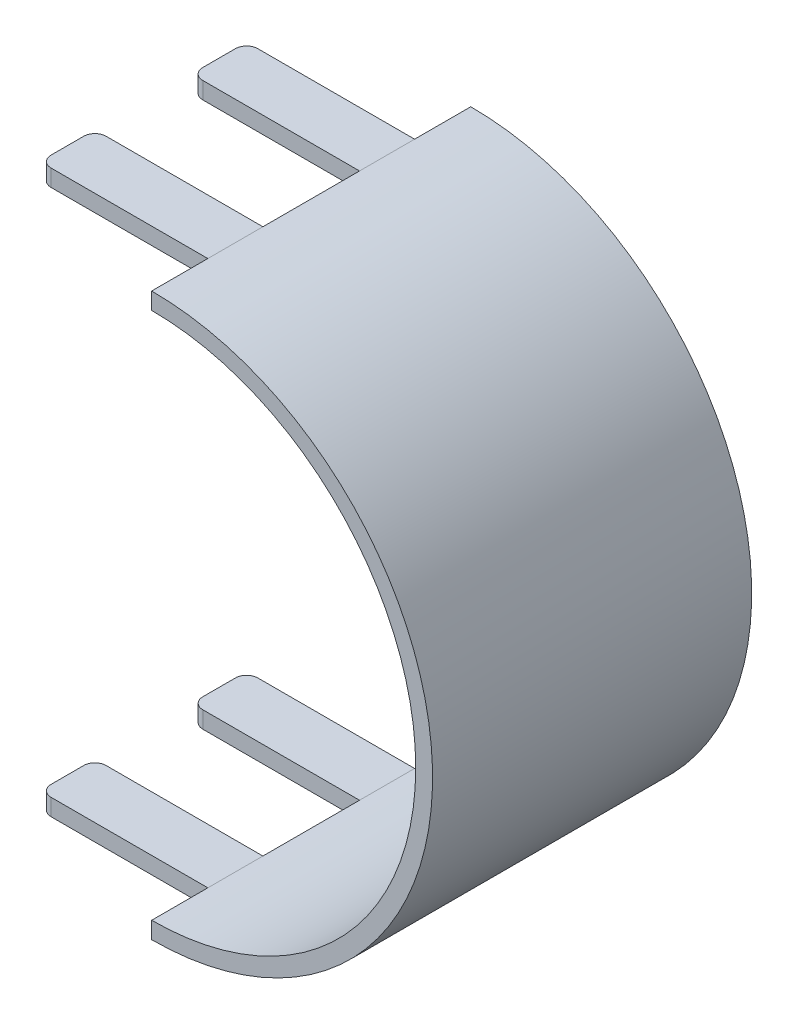
ISO-10303-21;
HEADER;
FILE_DESCRIPTION(('STEP AP214'),'2;1');
FILE_NAME('part.step','',(''),(''),'','','');
FILE_SCHEMA(('AUTOMOTIVE_DESIGN { 1 0 10303 214 1 1 1 1 }'));
ENDSEC;
DATA;
#1=APPLICATION_CONTEXT('core data for automotive mechanical design processes');
#2=APPLICATION_PROTOCOL_DEFINITION('international standard','automotive_design',2000,#1);
#3=PRODUCT_CONTEXT('',#1,'mechanical');
#4=PRODUCT('Part','Part','',(#3));
#5=PRODUCT_RELATED_PRODUCT_CATEGORY('part','',(#4));
#6=PRODUCT_DEFINITION_FORMATION('','',#4);
#7=PRODUCT_DEFINITION_CONTEXT('part definition',#1,'design');
#8=PRODUCT_DEFINITION('design','',#6,#7);
#9=PRODUCT_DEFINITION_SHAPE('','',#8);
#10=(LENGTH_UNIT() NAMED_UNIT(*) SI_UNIT(.MILLI.,.METRE.));
#11=(NAMED_UNIT(*) PLANE_ANGLE_UNIT() SI_UNIT($,.RADIAN.));
#12=(NAMED_UNIT(*) SI_UNIT($,.STERADIAN.) SOLID_ANGLE_UNIT());
#13=UNCERTAINTY_MEASURE_WITH_UNIT(LENGTH_MEASURE(1.E-05),#10,'distance_accuracy_value','');
#14=(GEOMETRIC_REPRESENTATION_CONTEXT(3) GLOBAL_UNCERTAINTY_ASSIGNED_CONTEXT((#13)) GLOBAL_UNIT_ASSIGNED_CONTEXT((#10,
#11,#12)) REPRESENTATION_CONTEXT('',''));
#15=CARTESIAN_POINT('',(0.,0.,0.));
#16=DIRECTION('',(0.,0.,1.));
#17=DIRECTION('',(1.,0.,0.));
#18=AXIS2_PLACEMENT_3D('',#15,#16,#17);
#19=CARTESIAN_POINT('',(300.,0.,60.));
#20=DIRECTION('',(0.,0.,-1.));
#21=DIRECTION('',(-1.,0.,0.));
#22=AXIS2_PLACEMENT_3D('',#19,#20,#21);
#23=CYLINDRICAL_SURFACE('',#22,50.);
#24=DIRECTION('',(0.,0.,-1.));
#25=VECTOR('',#24,1.);
#26=CARTESIAN_POINT('',(300.,50.,60.));
#27=LINE('',#26,#25);
#28=CARTESIAN_POINT('',(300.,50.,59.9));
#29=VERTEX_POINT('',#28);
#30=CARTESIAN_POINT('',(300.,50.,49.9));
#31=VERTEX_POINT('',#30);
#32=EDGE_CURVE('E258',#29,#31,#27,.T.);
#33=ORIENTED_EDGE('',*,*,#32,.F.);
#34=CARTESIAN_POINT('',(300.,0.,59.9));
#35=DIRECTION('',(0.,0.,-1.));
#36=DIRECTION('',(-1.,0.,0.));
#37=AXIS2_PLACEMENT_3D('',#34,#35,#36);
#38=CIRCLE('',#37,50.);
#39=CARTESIAN_POINT('',(300.,-50.,59.9));
#40=VERTEX_POINT('',#39);
#41=EDGE_CURVE('E225',#29,#40,#38,.T.);
#42=ORIENTED_EDGE('',*,*,#41,.T.);
#43=DIRECTION('',(0.,0.,-1.));
#44=VECTOR('',#43,1.);
#45=CARTESIAN_POINT('',(300.,-50.,60.));
#46=LINE('',#45,#44);
#47=CARTESIAN_POINT('',(300.,-50.,49.9));
#48=VERTEX_POINT('',#47);
#49=EDGE_CURVE('E256',#40,#48,#46,.T.);
#50=ORIENTED_EDGE('',*,*,#49,.T.);
#51=DIRECTION('',(0.,0.,-1.));
#52=VECTOR('',#51,1.);
#53=CARTESIAN_POINT('',(300.,-50.,60.));
#54=LINE('',#53,#52);
#55=CARTESIAN_POINT('',(300.,-50.,40.1));
#56=VERTEX_POINT('',#55);
#57=EDGE_CURVE('E434',#48,#56,#54,.T.);
#58=ORIENTED_EDGE('',*,*,#57,.T.);
#59=CARTESIAN_POINT('',(300.,-50.,22.9));
#60=VERTEX_POINT('',#59);
#61=EDGE_CURVE('E447',#56,#60,#46,.T.);
#62=ORIENTED_EDGE('',*,*,#61,.T.);
#63=DIRECTION('',(0.,0.,-1.));
#64=VECTOR('',#63,1.);
#65=CARTESIAN_POINT('',(300.,-50.,60.));
#66=LINE('',#65,#64);
#67=CARTESIAN_POINT('',(300.,-50.,13.1));
#68=VERTEX_POINT('',#67);
#69=EDGE_CURVE('E431',#60,#68,#66,.T.);
#70=ORIENTED_EDGE('',*,*,#69,.T.);
#71=CARTESIAN_POINT('',(300.,-50.,3.1));
#72=VERTEX_POINT('',#71);
#73=EDGE_CURVE('E260',#68,#72,#46,.T.);
#74=ORIENTED_EDGE('',*,*,#73,.T.);
#75=CARTESIAN_POINT('',(300.,0.,3.1));
#76=DIRECTION('',(0.,0.,-1.));
#77=DIRECTION('',(-1.,0.,0.));
#78=AXIS2_PLACEMENT_3D('',#75,#76,#77);
#79=CIRCLE('',#78,50.);
#80=CARTESIAN_POINT('',(300.,50.,3.1));
#81=VERTEX_POINT('',#80);
#82=EDGE_CURVE('E361',#81,#72,#79,.T.);
#83=ORIENTED_EDGE('',*,*,#82,.F.);
#84=CARTESIAN_POINT('',(300.,50.,13.1));
#85=VERTEX_POINT('',#84);
#86=EDGE_CURVE('E250',#85,#81,#27,.T.);
#87=ORIENTED_EDGE('',*,*,#86,.F.);
#88=DIRECTION('',(0.,0.,-1.));
#89=VECTOR('',#88,1.);
#90=CARTESIAN_POINT('',(300.,50.,60.));
#91=LINE('',#90,#89);
#92=CARTESIAN_POINT('',(300.,50.,22.9));
#93=VERTEX_POINT('',#92);
#94=EDGE_CURVE('E424',#93,#85,#91,.T.);
#95=ORIENTED_EDGE('',*,*,#94,.F.);
#96=CARTESIAN_POINT('',(300.,50.,40.1));
#97=VERTEX_POINT('',#96);
#98=EDGE_CURVE('E261',#97,#93,#27,.T.);
#99=ORIENTED_EDGE('',*,*,#98,.F.);
#100=DIRECTION('',(0.,0.,-1.));
#101=VECTOR('',#100,1.);
#102=CARTESIAN_POINT('',(300.,50.,60.));
#103=LINE('',#102,#101);
#104=EDGE_CURVE('E440',#31,#97,#103,.T.);
#105=ORIENTED_EDGE('',*,*,#104,.F.);
#106=EDGE_LOOP('',(#33,#42,#50,#58,#62,#70,#74,#83,#87,#95,#99,#105));
#107=FACE_BOUND('',#106,.T.);
#108=ADVANCED_FACE('F33',(#107),#23,.T.);
#109=CARTESIAN_POINT('',(300.,1.71683972880179E-13,0.));
#110=DIRECTION('',(-1.,0.,0.));
#111=DIRECTION('',(0.,-1.,0.));
#112=AXIS2_PLACEMENT_3D('',#109,#110,#111);
#113=PLANE('',#112);
#114=DIRECTION('',(0.,0.,1.));
#115=VECTOR('',#114,1.);
#116=CARTESIAN_POINT('',(300.,-47.,3.));
#117=LINE('',#116,#115);
#118=CARTESIAN_POINT('',(300.,-47.,3.1));
#119=VERTEX_POINT('',#118);
#120=CARTESIAN_POINT('',(300.,-47.,13.1));
#121=VERTEX_POINT('',#120);
#122=EDGE_CURVE('E263',#119,#121,#117,.T.);
#123=ORIENTED_EDGE('',*,*,#122,.F.);
#124=DIRECTION('',(0.,-1.,0.));
#125=VECTOR('',#124,1.);
#126=CARTESIAN_POINT('',(300.,1.71683972880179E-13,3.1));
#127=LINE('',#126,#125);
#128=EDGE_CURVE('E462',#119,#72,#127,.T.);
#129=ORIENTED_EDGE('',*,*,#128,.T.);
#130=ORIENTED_EDGE('',*,*,#73,.F.);
#131=DIRECTION('',(0.,1.,0.));
#132=VECTOR('',#131,1.);
#133=CARTESIAN_POINT('',(300.,-120.,13.1));
#134=LINE('',#133,#132);
#135=EDGE_CURVE('E401',#68,#121,#134,.T.);
#136=ORIENTED_EDGE('',*,*,#135,.T.);
#137=EDGE_LOOP('',(#123,#129,#130,#136));
#138=FACE_BOUND('',#137,.T.);
#139=ADVANCED_FACE('F460',(#138),#113,.T.);
#140=CARTESIAN_POINT('',(300.,0.,3.));
#141=DIRECTION('',(0.,0.,1.));
#142=DIRECTION('',(1.,0.,0.));
#143=AXIS2_PLACEMENT_3D('',#140,#141,#142);
#144=CYLINDRICAL_SURFACE('',#143,47.);
#145=CARTESIAN_POINT('',(300.,-47.,49.9));
#146=VERTEX_POINT('',#145);
#147=CARTESIAN_POINT('',(300.,-47.,59.9));
#148=VERTEX_POINT('',#147);
#149=EDGE_CURVE('E239',#146,#148,#117,.T.);
#150=ORIENTED_EDGE('',*,*,#149,.T.);
#151=CARTESIAN_POINT('',(300.,0.,59.9));
#152=DIRECTION('',(0.,0.,-1.));
#153=DIRECTION('',(-1.,0.,0.));
#154=AXIS2_PLACEMENT_3D('',#151,#152,#153);
#155=CIRCLE('',#154,47.);
#156=CARTESIAN_POINT('',(300.,47.,59.9));
#157=VERTEX_POINT('',#156);
#158=EDGE_CURVE('E222',#148,#157,#155,.F.);
#159=ORIENTED_EDGE('',*,*,#158,.T.);
#160=DIRECTION('',(0.,0.,1.));
#161=VECTOR('',#160,1.);
#162=CARTESIAN_POINT('',(300.,47.,3.));
#163=LINE('',#162,#161);
#164=CARTESIAN_POINT('',(300.,47.,49.9));
#165=VERTEX_POINT('',#164);
#166=EDGE_CURVE('E236',#165,#157,#163,.T.);
#167=ORIENTED_EDGE('',*,*,#166,.F.);
#168=DIRECTION('',(0.,0.,1.));
#169=VECTOR('',#168,1.);
#170=CARTESIAN_POINT('',(300.,47.,3.));
#171=LINE('',#170,#169);
#172=CARTESIAN_POINT('',(300.,47.,40.1));
#173=VERTEX_POINT('',#172);
#174=EDGE_CURVE('E252',#173,#165,#171,.T.);
#175=ORIENTED_EDGE('',*,*,#174,.F.);
#176=CARTESIAN_POINT('',(300.,47.,22.9));
#177=VERTEX_POINT('',#176);
#178=EDGE_CURVE('E247',#177,#173,#171,.T.);
#179=ORIENTED_EDGE('',*,*,#178,.F.);
#180=DIRECTION('',(0.,0.,1.));
#181=VECTOR('',#180,1.);
#182=CARTESIAN_POINT('',(300.,47.,3.));
#183=LINE('',#182,#181);
#184=CARTESIAN_POINT('',(300.,47.,13.1));
#185=VERTEX_POINT('',#184);
#186=EDGE_CURVE('E425',#185,#177,#183,.T.);
#187=ORIENTED_EDGE('',*,*,#186,.F.);
#188=CARTESIAN_POINT('',(300.,47.,3.1));
#189=VERTEX_POINT('',#188);
#190=EDGE_CURVE('E246',#189,#185,#163,.T.);
#191=ORIENTED_EDGE('',*,*,#190,.F.);
#192=CARTESIAN_POINT('',(300.,0.,3.1));
#193=DIRECTION('',(0.,0.,-1.));
#194=DIRECTION('',(-1.,0.,0.));
#195=AXIS2_PLACEMENT_3D('',#192,#193,#194);
#196=CIRCLE('',#195,47.);
#197=EDGE_CURVE('E840',#119,#189,#196,.F.);
#198=ORIENTED_EDGE('',*,*,#197,.F.);
#199=ORIENTED_EDGE('',*,*,#122,.T.);
#200=DIRECTION('',(0.,0.,1.));
#201=VECTOR('',#200,1.);
#202=CARTESIAN_POINT('',(300.,-47.,3.));
#203=LINE('',#202,#201);
#204=CARTESIAN_POINT('',(300.,-47.,22.9));
#205=VERTEX_POINT('',#204);
#206=EDGE_CURVE('E428',#121,#205,#203,.T.);
#207=ORIENTED_EDGE('',*,*,#206,.T.);
#208=DIRECTION('',(0.,0.,1.));
#209=VECTOR('',#208,1.);
#210=CARTESIAN_POINT('',(300.,-47.,3.));
#211=LINE('',#210,#209);
#212=CARTESIAN_POINT('',(300.,-47.,40.1));
#213=VERTEX_POINT('',#212);
#214=EDGE_CURVE('E437',#205,#213,#211,.T.);
#215=ORIENTED_EDGE('',*,*,#214,.T.);
#216=EDGE_CURVE('E441',#213,#146,#211,.T.);
#217=ORIENTED_EDGE('',*,*,#216,.T.);
#218=EDGE_LOOP('',(#150,#159,#167,#175,#179,#187,#191,#198,#199,#207,#215,#217));
#219=FACE_BOUND('',#218,.T.);
#220=ADVANCED_FACE('F234',(#219),#144,.F.);
#221=ORIENTED_EDGE('',*,*,#86,.T.);
#222=DIRECTION('',(0.,-1.,0.));
#223=VECTOR('',#222,1.);
#224=CARTESIAN_POINT('',(300.,1.71683972880179E-13,3.1));
#225=LINE('',#224,#223);
#226=EDGE_CURVE('E230',#81,#189,#225,.T.);
#227=ORIENTED_EDGE('',*,*,#226,.T.);
#228=ORIENTED_EDGE('',*,*,#190,.T.);
#229=EDGE_CURVE('E398',#185,#85,#134,.T.);
#230=ORIENTED_EDGE('',*,*,#229,.T.);
#231=EDGE_LOOP('',(#221,#227,#228,#230));
#232=FACE_BOUND('',#231,.T.);
#233=ADVANCED_FACE('F515',(#232),#113,.T.);
#234=CARTESIAN_POINT('',(300.,47.,3.));
#235=DIRECTION('',(0.,1.,0.));
#236=DIRECTION('',(0.,0.,1.));
#237=AXIS2_PLACEMENT_3D('',#234,#235,#236);
#238=PLANE('',#237);
#239=DIRECTION('',(0.,0.,-1.));
#240=VECTOR('',#239,1.);
#241=CARTESIAN_POINT('',(270.1,47.,3.));
#242=LINE('',#241,#240);
#243=CARTESIAN_POINT('',(270.1,47.,20.9));
#244=VERTEX_POINT('',#243);
#245=CARTESIAN_POINT('',(270.1,47.,15.1));
#246=VERTEX_POINT('',#245);
#247=EDGE_CURVE('E370',#244,#246,#242,.T.);
#248=ORIENTED_EDGE('',*,*,#247,.T.);
#249=CARTESIAN_POINT('',(272.1,47.,15.1));
#250=DIRECTION('',(0.,1.,0.));
#251=DIRECTION('',(0.,0.,1.));
#252=AXIS2_PLACEMENT_3D('',#249,#250,#251);
#253=CIRCLE('',#252,2.);
#254=CARTESIAN_POINT('',(272.1,47.,13.1));
#255=VERTEX_POINT('',#254);
#256=EDGE_CURVE('E313',#246,#255,#253,.F.);
#257=ORIENTED_EDGE('',*,*,#256,.T.);
#258=DIRECTION('',(1.,0.,0.));
#259=VECTOR('',#258,1.);
#260=CARTESIAN_POINT('',(300.,47.,13.1));
#261=LINE('',#260,#259);
#262=EDGE_CURVE('E407',#255,#185,#261,.T.);
#263=ORIENTED_EDGE('',*,*,#262,.T.);
#264=ORIENTED_EDGE('',*,*,#186,.T.);
#265=DIRECTION('',(-1.,0.,0.));
#266=VECTOR('',#265,1.);
#267=CARTESIAN_POINT('',(300.,47.,22.9));
#268=LINE('',#267,#266);
#269=CARTESIAN_POINT('',(272.1,47.,22.9));
#270=VERTEX_POINT('',#269);
#271=EDGE_CURVE('E421',#177,#270,#268,.T.);
#272=ORIENTED_EDGE('',*,*,#271,.T.);
#273=CARTESIAN_POINT('',(272.1,47.,20.9));
#274=DIRECTION('',(0.,1.,0.));
#275=DIRECTION('',(0.,0.,1.));
#276=AXIS2_PLACEMENT_3D('',#273,#274,#275);
#277=CIRCLE('',#276,2.);
#278=EDGE_CURVE('E311',#270,#244,#277,.F.);
#279=ORIENTED_EDGE('',*,*,#278,.T.);
#280=EDGE_LOOP('',(#248,#257,#263,#264,#272,#279));
#281=FACE_BOUND('',#280,.T.);
#282=ADVANCED_FACE('F602',(#281),#238,.F.);
#283=CARTESIAN_POINT('',(300.,47.,3.));
#284=DIRECTION('',(0.,1.,0.));
#285=DIRECTION('',(0.,0.,1.));
#286=AXIS2_PLACEMENT_3D('',#283,#284,#285);
#287=PLANE('',#286);
#288=DIRECTION('',(0.,0.,-1.));
#289=VECTOR('',#288,1.);
#290=CARTESIAN_POINT('',(270.1,47.,3.));
#291=LINE('',#290,#289);
#292=CARTESIAN_POINT('',(270.1,47.,47.9));
#293=VERTEX_POINT('',#292);
#294=CARTESIAN_POINT('',(270.1,47.,42.1));
#295=VERTEX_POINT('',#294);
#296=EDGE_CURVE('E335',#293,#295,#291,.T.);
#297=ORIENTED_EDGE('',*,*,#296,.T.);
#298=CARTESIAN_POINT('',(272.1,47.,42.1));
#299=DIRECTION('',(0.,1.,0.));
#300=DIRECTION('',(0.,0.,1.));
#301=AXIS2_PLACEMENT_3D('',#298,#299,#300);
#302=CIRCLE('',#301,2.);
#303=CARTESIAN_POINT('',(272.1,47.,40.1));
#304=VERTEX_POINT('',#303);
#305=EDGE_CURVE('E41',#295,#304,#302,.F.);
#306=ORIENTED_EDGE('',*,*,#305,.T.);
#307=DIRECTION('',(1.,0.,0.));
#308=VECTOR('',#307,1.);
#309=CARTESIAN_POINT('',(300.,47.,40.1));
#310=LINE('',#309,#308);
#311=EDGE_CURVE('E334',#304,#173,#310,.T.);
#312=ORIENTED_EDGE('',*,*,#311,.T.);
#313=ORIENTED_EDGE('',*,*,#174,.T.);
#314=DIRECTION('',(-1.,0.,0.));
#315=VECTOR('',#314,1.);
#316=CARTESIAN_POINT('',(300.,47.,49.9));
#317=LINE('',#316,#315);
#318=CARTESIAN_POINT('',(272.1,47.,49.9));
#319=VERTEX_POINT('',#318);
#320=EDGE_CURVE('E391',#165,#319,#317,.T.);
#321=ORIENTED_EDGE('',*,*,#320,.T.);
#322=CARTESIAN_POINT('',(272.1,47.,47.9));
#323=DIRECTION('',(0.,1.,0.));
#324=DIRECTION('',(0.,0.,1.));
#325=AXIS2_PLACEMENT_3D('',#322,#323,#324);
#326=CIRCLE('',#325,2.);
#327=EDGE_CURVE('E329',#319,#293,#326,.F.);
#328=ORIENTED_EDGE('',*,*,#327,.T.);
#329=EDGE_LOOP('',(#297,#306,#312,#313,#321,#328));
#330=FACE_BOUND('',#329,.T.);
#331=ADVANCED_FACE('F333',(#330),#287,.F.);
#332=CARTESIAN_POINT('',(-300.,-47.,3.));
#333=DIRECTION('',(0.,-1.,0.));
#334=DIRECTION('',(0.,0.,-1.));
#335=AXIS2_PLACEMENT_3D('',#332,#333,#334);
#336=PLANE('',#335);
#337=DIRECTION('',(0.,0.,1.));
#338=VECTOR('',#337,1.);
#339=CARTESIAN_POINT('',(270.1,-47.,3.));
#340=LINE('',#339,#338);
#341=CARTESIAN_POINT('',(270.1,-47.,42.1));
#342=VERTEX_POINT('',#341);
#343=CARTESIAN_POINT('',(270.1,-47.,47.9));
#344=VERTEX_POINT('',#343);
#345=EDGE_CURVE('E367',#342,#344,#340,.T.);
#346=ORIENTED_EDGE('',*,*,#345,.T.);
#347=CARTESIAN_POINT('',(272.1,-47.,47.9));
#348=DIRECTION('',(0.,-1.,0.));
#349=DIRECTION('',(0.,0.,-1.));
#350=AXIS2_PLACEMENT_3D('',#347,#348,#349);
#351=CIRCLE('',#350,2.);
#352=CARTESIAN_POINT('',(272.1,-47.,49.9));
#353=VERTEX_POINT('',#352);
#354=EDGE_CURVE('E277',#344,#353,#351,.F.);
#355=ORIENTED_EDGE('',*,*,#354,.T.);
#356=DIRECTION('',(1.,0.,0.));
#357=VECTOR('',#356,1.);
#358=CARTESIAN_POINT('',(-300.,-47.,49.9));
#359=LINE('',#358,#357);
#360=EDGE_CURVE('E389',#353,#146,#359,.T.);
#361=ORIENTED_EDGE('',*,*,#360,.T.);
#362=ORIENTED_EDGE('',*,*,#216,.F.);
#363=DIRECTION('',(-1.,0.,0.));
#364=VECTOR('',#363,1.);
#365=CARTESIAN_POINT('',(-300.,-47.,40.1));
#366=LINE('',#365,#364);
#367=CARTESIAN_POINT('',(272.1,-47.,40.1));
#368=VERTEX_POINT('',#367);
#369=EDGE_CURVE('E345',#213,#368,#366,.T.);
#370=ORIENTED_EDGE('',*,*,#369,.T.);
#371=CARTESIAN_POINT('',(272.1,-47.,42.1));
#372=DIRECTION('',(0.,-1.,0.));
#373=DIRECTION('',(0.,0.,-1.));
#374=AXIS2_PLACEMENT_3D('',#371,#372,#373);
#375=CIRCLE('',#374,2.);
#376=EDGE_CURVE('E275',#368,#342,#375,.F.);
#377=ORIENTED_EDGE('',*,*,#376,.T.);
#378=EDGE_LOOP('',(#346,#355,#361,#362,#370,#377));
#379=FACE_BOUND('',#378,.T.);
#380=ADVANCED_FACE('F536',(#379),#336,.F.);
#381=CARTESIAN_POINT('',(-300.,-47.,3.));
#382=DIRECTION('',(0.,-1.,0.));
#383=DIRECTION('',(0.,0.,-1.));
#384=AXIS2_PLACEMENT_3D('',#381,#382,#383);
#385=PLANE('',#384);
#386=DIRECTION('',(0.,0.,1.));
#387=VECTOR('',#386,1.);
#388=CARTESIAN_POINT('',(270.1,-47.,3.));
#389=LINE('',#388,#387);
#390=CARTESIAN_POINT('',(270.1,-47.,15.1));
#391=VERTEX_POINT('',#390);
#392=CARTESIAN_POINT('',(270.1,-47.,20.9));
#393=VERTEX_POINT('',#392);
#394=EDGE_CURVE('E376',#391,#393,#389,.T.);
#395=ORIENTED_EDGE('',*,*,#394,.T.);
#396=CARTESIAN_POINT('',(272.1,-47.,20.9));
#397=DIRECTION('',(0.,-1.,0.));
#398=DIRECTION('',(0.,0.,-1.));
#399=AXIS2_PLACEMENT_3D('',#396,#397,#398);
#400=CIRCLE('',#399,2.);
#401=CARTESIAN_POINT('',(272.1,-47.,22.9));
#402=VERTEX_POINT('',#401);
#403=EDGE_CURVE('E295',#393,#402,#400,.F.);
#404=ORIENTED_EDGE('',*,*,#403,.T.);
#405=DIRECTION('',(1.,0.,0.));
#406=VECTOR('',#405,1.);
#407=CARTESIAN_POINT('',(-300.,-47.,22.9000000000001));
#408=LINE('',#407,#406);
#409=EDGE_CURVE('E419',#402,#205,#408,.T.);
#410=ORIENTED_EDGE('',*,*,#409,.T.);
#411=ORIENTED_EDGE('',*,*,#206,.F.);
#412=DIRECTION('',(-1.,0.,0.));
#413=VECTOR('',#412,1.);
#414=CARTESIAN_POINT('',(-300.,-47.,13.1000000000001));
#415=LINE('',#414,#413);
#416=CARTESIAN_POINT('',(272.1,-47.,13.1));
#417=VERTEX_POINT('',#416);
#418=EDGE_CURVE('E404',#121,#417,#415,.T.);
#419=ORIENTED_EDGE('',*,*,#418,.T.);
#420=CARTESIAN_POINT('',(272.1,-47.,15.1));
#421=DIRECTION('',(0.,-1.,0.));
#422=DIRECTION('',(0.,0.,-1.));
#423=AXIS2_PLACEMENT_3D('',#420,#421,#422);
#424=CIRCLE('',#423,2.);
#425=EDGE_CURVE('E293',#417,#391,#424,.F.);
#426=ORIENTED_EDGE('',*,*,#425,.T.);
#427=EDGE_LOOP('',(#395,#404,#410,#411,#419,#426));
#428=FACE_BOUND('',#427,.T.);
#429=ADVANCED_FACE('F469',(#428),#385,.F.);
#430=CARTESIAN_POINT('',(-300.,-50.,60.));
#431=DIRECTION('',(0.,1.,0.));
#432=DIRECTION('',(0.,0.,1.));
#433=AXIS2_PLACEMENT_3D('',#430,#431,#432);
#434=PLANE('',#433);
#435=DIRECTION('',(-1.,0.,0.));
#436=VECTOR('',#435,1.);
#437=CARTESIAN_POINT('',(-300.,-50.,22.9000000000001));
#438=LINE('',#437,#436);
#439=CARTESIAN_POINT('',(272.1,-50.,22.9));
#440=VERTEX_POINT('',#439);
#441=EDGE_CURVE('E416',#60,#440,#438,.T.);
#442=ORIENTED_EDGE('',*,*,#441,.T.);
#443=CARTESIAN_POINT('',(272.1,-50.,20.9));
#444=DIRECTION('',(0.,1.,0.));
#445=DIRECTION('',(0.,0.,1.));
#446=AXIS2_PLACEMENT_3D('',#443,#444,#445);
#447=CIRCLE('',#446,2.);
#448=CARTESIAN_POINT('',(270.1,-50.,20.9));
#449=VERTEX_POINT('',#448);
#450=EDGE_CURVE('E287',#440,#449,#447,.F.);
#451=ORIENTED_EDGE('',*,*,#450,.T.);
#452=DIRECTION('',(0.,0.,-1.));
#453=VECTOR('',#452,1.);
#454=CARTESIAN_POINT('',(270.1,-50.,60.));
#455=LINE('',#454,#453);
#456=CARTESIAN_POINT('',(270.1,-50.,15.1));
#457=VERTEX_POINT('',#456);
#458=EDGE_CURVE('E373',#449,#457,#455,.T.);
#459=ORIENTED_EDGE('',*,*,#458,.T.);
#460=CARTESIAN_POINT('',(272.1,-50.,15.1));
#461=DIRECTION('',(0.,1.,0.));
#462=DIRECTION('',(0.,0.,1.));
#463=AXIS2_PLACEMENT_3D('',#460,#461,#462);
#464=CIRCLE('',#463,2.);
#465=CARTESIAN_POINT('',(272.1,-50.,13.1));
#466=VERTEX_POINT('',#465);
#467=EDGE_CURVE('E285',#457,#466,#464,.F.);
#468=ORIENTED_EDGE('',*,*,#467,.T.);
#469=DIRECTION('',(1.,0.,0.));
#470=VECTOR('',#469,1.);
#471=CARTESIAN_POINT('',(-300.,-50.,13.1000000000001));
#472=LINE('',#471,#470);
#473=EDGE_CURVE('E402',#466,#68,#472,.T.);
#474=ORIENTED_EDGE('',*,*,#473,.T.);
#475=ORIENTED_EDGE('',*,*,#69,.F.);
#476=EDGE_LOOP('',(#442,#451,#459,#468,#474,#475));
#477=FACE_BOUND('',#476,.T.);
#478=ADVANCED_FACE('F484',(#477),#434,.F.);
#479=CARTESIAN_POINT('',(-300.,-50.,60.));
#480=DIRECTION('',(0.,1.,0.));
#481=DIRECTION('',(0.,0.,1.));
#482=AXIS2_PLACEMENT_3D('',#479,#480,#481);
#483=PLANE('',#482);
#484=DIRECTION('',(-1.,0.,0.));
#485=VECTOR('',#484,1.);
#486=CARTESIAN_POINT('',(-300.,-50.,49.9));
#487=LINE('',#486,#485);
#488=CARTESIAN_POINT('',(272.1,-50.,49.9));
#489=VERTEX_POINT('',#488);
#490=EDGE_CURVE('E386',#48,#489,#487,.T.);
#491=ORIENTED_EDGE('',*,*,#490,.T.);
#492=CARTESIAN_POINT('',(272.1,-50.,47.9));
#493=DIRECTION('',(0.,1.,0.));
#494=DIRECTION('',(0.,0.,1.));
#495=AXIS2_PLACEMENT_3D('',#492,#493,#494);
#496=CIRCLE('',#495,2.);
#497=CARTESIAN_POINT('',(270.1,-50.,47.9));
#498=VERTEX_POINT('',#497);
#499=EDGE_CURVE('E269',#489,#498,#496,.F.);
#500=ORIENTED_EDGE('',*,*,#499,.T.);
#501=DIRECTION('',(0.,0.,-1.));
#502=VECTOR('',#501,1.);
#503=CARTESIAN_POINT('',(270.1,-50.,60.));
#504=LINE('',#503,#502);
#505=CARTESIAN_POINT('',(270.1,-50.,42.1));
#506=VERTEX_POINT('',#505);
#507=EDGE_CURVE('E358',#498,#506,#504,.T.);
#508=ORIENTED_EDGE('',*,*,#507,.T.);
#509=CARTESIAN_POINT('',(272.1,-50.,42.1));
#510=DIRECTION('',(0.,1.,0.));
#511=DIRECTION('',(0.,0.,1.));
#512=AXIS2_PLACEMENT_3D('',#509,#510,#511);
#513=CIRCLE('',#512,2.);
#514=CARTESIAN_POINT('',(272.1,-50.,40.1));
#515=VERTEX_POINT('',#514);
#516=EDGE_CURVE('E267',#506,#515,#513,.F.);
#517=ORIENTED_EDGE('',*,*,#516,.T.);
#518=DIRECTION('',(1.,0.,0.));
#519=VECTOR('',#518,1.);
#520=CARTESIAN_POINT('',(-300.,-50.,40.1));
#521=LINE('',#520,#519);
#522=EDGE_CURVE('E393',#515,#56,#521,.T.);
#523=ORIENTED_EDGE('',*,*,#522,.T.);
#524=ORIENTED_EDGE('',*,*,#57,.F.);
#525=EDGE_LOOP('',(#491,#500,#508,#517,#523,#524));
#526=FACE_BOUND('',#525,.T.);
#527=ADVANCED_FACE('F555',(#526),#483,.F.);
#528=DIRECTION('',(0.,-1.,0.));
#529=VECTOR('',#528,1.);
#530=CARTESIAN_POINT('',(300.,1.71683972880179E-13,59.9));
#531=LINE('',#530,#529);
#532=EDGE_CURVE('E838',#148,#40,#531,.T.);
#533=ORIENTED_EDGE('',*,*,#532,.F.);
#534=ORIENTED_EDGE('',*,*,#149,.F.);
#535=DIRECTION('',(0.,1.,0.));
#536=VECTOR('',#535,1.);
#537=CARTESIAN_POINT('',(300.,-120.,49.9));
#538=LINE('',#537,#536);
#539=EDGE_CURVE('E381',#48,#146,#538,.T.);
#540=ORIENTED_EDGE('',*,*,#539,.F.);
#541=ORIENTED_EDGE('',*,*,#49,.F.);
#542=EDGE_LOOP('',(#533,#534,#540,#541));
#543=FACE_BOUND('',#542,.T.);
#544=ADVANCED_FACE('F523',(#543),#113,.T.);
#545=CARTESIAN_POINT('',(-300.,50.,60.));
#546=DIRECTION('',(0.,-1.,0.));
#547=DIRECTION('',(0.,0.,-1.));
#548=AXIS2_PLACEMENT_3D('',#545,#546,#547);
#549=PLANE('',#548);
#550=DIRECTION('',(1.,0.,0.));
#551=VECTOR('',#550,1.);
#552=CARTESIAN_POINT('',(300.,50.,40.1));
#553=LINE('',#552,#551);
#554=CARTESIAN_POINT('',(272.1,50.,40.1));
#555=VERTEX_POINT('',#554);
#556=EDGE_CURVE('E353',#555,#97,#553,.T.);
#557=ORIENTED_EDGE('',*,*,#556,.F.);
#558=CARTESIAN_POINT('',(272.1,50.,42.1));
#559=DIRECTION('',(0.,-1.,0.));
#560=DIRECTION('',(0.,0.,-1.));
#561=AXIS2_PLACEMENT_3D('',#558,#559,#560);
#562=CIRCLE('',#561,2.);
#563=CARTESIAN_POINT('',(270.1,50.,42.1));
#564=VERTEX_POINT('',#563);
#565=EDGE_CURVE('E323',#555,#564,#562,.F.);
#566=ORIENTED_EDGE('',*,*,#565,.T.);
#567=DIRECTION('',(0.,0.,-1.));
#568=VECTOR('',#567,1.);
#569=CARTESIAN_POINT('',(270.1,50.,13.1));
#570=LINE('',#569,#568);
#571=CARTESIAN_POINT('',(270.1,50.,47.9));
#572=VERTEX_POINT('',#571);
#573=EDGE_CURVE('E351',#572,#564,#570,.T.);
#574=ORIENTED_EDGE('',*,*,#573,.F.);
#575=CARTESIAN_POINT('',(272.1,50.,47.9));
#576=DIRECTION('',(0.,-1.,0.));
#577=DIRECTION('',(0.,0.,-1.));
#578=AXIS2_PLACEMENT_3D('',#575,#576,#577);
#579=CIRCLE('',#578,2.);
#580=CARTESIAN_POINT('',(272.1,50.,49.9));
#581=VERTEX_POINT('',#580);
#582=EDGE_CURVE('E321',#572,#581,#579,.F.);
#583=ORIENTED_EDGE('',*,*,#582,.T.);
#584=DIRECTION('',(-1.,0.,0.));
#585=VECTOR('',#584,1.);
#586=CARTESIAN_POINT('',(270.,50.,49.9));
#587=LINE('',#586,#585);
#588=EDGE_CURVE('E379',#31,#581,#587,.T.);
#589=ORIENTED_EDGE('',*,*,#588,.F.);
#590=ORIENTED_EDGE('',*,*,#104,.T.);
#591=EDGE_LOOP('',(#557,#566,#574,#583,#589,#590));
#592=FACE_BOUND('',#591,.T.);
#593=ADVANCED_FACE('F350',(#592),#549,.F.);
#594=DIRECTION('',(0.,-1.,0.));
#595=VECTOR('',#594,1.);
#596=CARTESIAN_POINT('',(300.,1.71683972880179E-13,59.9));
#597=LINE('',#596,#595);
#598=EDGE_CURVE('E219',#29,#157,#597,.T.);
#599=ORIENTED_EDGE('',*,*,#598,.F.);
#600=ORIENTED_EDGE('',*,*,#32,.T.);
#601=EDGE_CURVE('E244',#165,#31,#538,.T.);
#602=ORIENTED_EDGE('',*,*,#601,.F.);
#603=ORIENTED_EDGE('',*,*,#166,.T.);
#604=EDGE_LOOP('',(#599,#600,#602,#603));
#605=FACE_BOUND('',#604,.T.);
#606=ADVANCED_FACE('F242',(#605),#113,.T.);
#607=CARTESIAN_POINT('',(-300.,50.,60.));
#608=DIRECTION('',(0.,-1.,0.));
#609=DIRECTION('',(0.,0.,-1.));
#610=AXIS2_PLACEMENT_3D('',#607,#608,#609);
#611=PLANE('',#610);
#612=DIRECTION('',(1.,0.,0.));
#613=VECTOR('',#612,1.);
#614=CARTESIAN_POINT('',(300.,50.,13.1));
#615=LINE('',#614,#613);
#616=CARTESIAN_POINT('',(272.1,50.,13.1));
#617=VERTEX_POINT('',#616);
#618=EDGE_CURVE('E344',#617,#85,#615,.T.);
#619=ORIENTED_EDGE('',*,*,#618,.F.);
#620=CARTESIAN_POINT('',(272.1,50.,15.1));
#621=DIRECTION('',(0.,-1.,0.));
#622=DIRECTION('',(0.,0.,-1.));
#623=AXIS2_PLACEMENT_3D('',#620,#621,#622);
#624=CIRCLE('',#623,2.);
#625=CARTESIAN_POINT('',(270.1,50.,15.1));
#626=VERTEX_POINT('',#625);
#627=EDGE_CURVE('E305',#617,#626,#624,.F.);
#628=ORIENTED_EDGE('',*,*,#627,.T.);
#629=CARTESIAN_POINT('',(270.1,50.,20.9));
#630=VERTEX_POINT('',#629);
#631=EDGE_CURVE('E356',#630,#626,#570,.T.);
#632=ORIENTED_EDGE('',*,*,#631,.F.);
#633=CARTESIAN_POINT('',(272.1,50.,20.9));
#634=DIRECTION('',(0.,-1.,0.));
#635=DIRECTION('',(0.,0.,-1.));
#636=AXIS2_PLACEMENT_3D('',#633,#634,#635);
#637=CIRCLE('',#636,2.);
#638=CARTESIAN_POINT('',(272.1,50.,22.9));
#639=VERTEX_POINT('',#638);
#640=EDGE_CURVE('E303',#630,#639,#637,.F.);
#641=ORIENTED_EDGE('',*,*,#640,.T.);
#642=DIRECTION('',(-1.,0.,0.));
#643=VECTOR('',#642,1.);
#644=CARTESIAN_POINT('',(300.,50.,22.9));
#645=LINE('',#644,#643);
#646=EDGE_CURVE('E409',#93,#639,#645,.T.);
#647=ORIENTED_EDGE('',*,*,#646,.F.);
#648=ORIENTED_EDGE('',*,*,#94,.T.);
#649=EDGE_LOOP('',(#619,#628,#632,#641,#647,#648));
#650=FACE_BOUND('',#649,.T.);
#651=ADVANCED_FACE('F522',(#650),#611,.F.);
#652=ORIENTED_EDGE('',*,*,#98,.T.);
#653=DIRECTION('',(0.,1.,0.));
#654=VECTOR('',#653,1.);
#655=CARTESIAN_POINT('',(300.,-120.,22.9));
#656=LINE('',#655,#654);
#657=EDGE_CURVE('E412',#177,#93,#656,.T.);
#658=ORIENTED_EDGE('',*,*,#657,.F.);
#659=ORIENTED_EDGE('',*,*,#178,.T.);
#660=DIRECTION('',(0.,1.,0.));
#661=VECTOR('',#660,1.);
#662=CARTESIAN_POINT('',(300.,-120.,40.1));
#663=LINE('',#662,#661);
#664=EDGE_CURVE('E343',#173,#97,#663,.T.);
#665=ORIENTED_EDGE('',*,*,#664,.T.);
#666=EDGE_LOOP('',(#652,#658,#659,#665));
#667=FACE_BOUND('',#666,.T.);
#668=ADVANCED_FACE('F562',(#667),#113,.T.);
#669=ORIENTED_EDGE('',*,*,#214,.F.);
#670=EDGE_CURVE('E415',#60,#205,#656,.T.);
#671=ORIENTED_EDGE('',*,*,#670,.F.);
#672=ORIENTED_EDGE('',*,*,#61,.F.);
#673=EDGE_CURVE('E383',#56,#213,#663,.T.);
#674=ORIENTED_EDGE('',*,*,#673,.T.);
#675=EDGE_LOOP('',(#669,#671,#672,#674));
#676=FACE_BOUND('',#675,.T.);
#677=ADVANCED_FACE('F480',(#676),#113,.T.);
#678=CARTESIAN_POINT('',(300.,-120.,22.9));
#679=DIRECTION('',(0.,0.,-1.));
#680=DIRECTION('',(-1.,0.,0.));
#681=AXIS2_PLACEMENT_3D('',#678,#679,#680);
#682=PLANE('',#681);
#683=ORIENTED_EDGE('',*,*,#409,.F.);
#684=DIRECTION('',(0.,-1.,0.));
#685=VECTOR('',#684,1.);
#686=CARTESIAN_POINT('',(272.1,-120.,22.9));
#687=LINE('',#686,#685);
#688=EDGE_CURVE('E282',#402,#440,#687,.T.);
#689=ORIENTED_EDGE('',*,*,#688,.T.);
#690=ORIENTED_EDGE('',*,*,#441,.F.);
#691=ORIENTED_EDGE('',*,*,#670,.T.);
#692=EDGE_LOOP('',(#683,#689,#690,#691));
#693=FACE_BOUND('',#692,.T.);
#694=ADVANCED_FACE('F476',(#693),#682,.F.);
#695=ORIENTED_EDGE('',*,*,#646,.T.);
#696=DIRECTION('',(0.,-1.,0.));
#697=VECTOR('',#696,1.);
#698=CARTESIAN_POINT('',(272.1,-120.,22.9));
#699=LINE('',#698,#697);
#700=EDGE_CURVE('E315',#639,#270,#699,.T.);
#701=ORIENTED_EDGE('',*,*,#700,.T.);
#702=ORIENTED_EDGE('',*,*,#271,.F.);
#703=ORIENTED_EDGE('',*,*,#657,.T.);
#704=EDGE_LOOP('',(#695,#701,#702,#703));
#705=FACE_BOUND('',#704,.T.);
#706=ADVANCED_FACE('F600',(#705),#682,.F.);
#707=CARTESIAN_POINT('',(300.,-120.,13.1));
#708=DIRECTION('',(0.,0.,1.));
#709=DIRECTION('',(1.,0.,0.));
#710=AXIS2_PLACEMENT_3D('',#707,#708,#709);
#711=PLANE('',#710);
#712=ORIENTED_EDGE('',*,*,#262,.F.);
#713=DIRECTION('',(0.,1.,0.));
#714=VECTOR('',#713,1.);
#715=CARTESIAN_POINT('',(272.1,-120.,13.1));
#716=LINE('',#715,#714);
#717=EDGE_CURVE('E300',#255,#617,#716,.T.);
#718=ORIENTED_EDGE('',*,*,#717,.T.);
#719=ORIENTED_EDGE('',*,*,#618,.T.);
#720=ORIENTED_EDGE('',*,*,#229,.F.);
#721=EDGE_LOOP('',(#712,#718,#719,#720));
#722=FACE_BOUND('',#721,.T.);
#723=ADVANCED_FACE('F608',(#722),#711,.F.);
#724=ORIENTED_EDGE('',*,*,#473,.F.);
#725=DIRECTION('',(0.,1.,0.));
#726=VECTOR('',#725,1.);
#727=CARTESIAN_POINT('',(272.1,-120.,13.1));
#728=LINE('',#727,#726);
#729=EDGE_CURVE('E297',#466,#417,#728,.T.);
#730=ORIENTED_EDGE('',*,*,#729,.T.);
#731=ORIENTED_EDGE('',*,*,#418,.F.);
#732=ORIENTED_EDGE('',*,*,#135,.F.);
#733=EDGE_LOOP('',(#724,#730,#731,#732));
#734=FACE_BOUND('',#733,.T.);
#735=ADVANCED_FACE('F465',(#734),#711,.F.);
#736=CARTESIAN_POINT('',(300.,-120.,40.1));
#737=DIRECTION('',(0.,0.,1.));
#738=DIRECTION('',(1.,0.,0.));
#739=AXIS2_PLACEMENT_3D('',#736,#737,#738);
#740=PLANE('',#739);
#741=ORIENTED_EDGE('',*,*,#522,.F.);
#742=DIRECTION('',(0.,1.,0.));
#743=VECTOR('',#742,1.);
#744=CARTESIAN_POINT('',(272.1,-120.,40.1));
#745=LINE('',#744,#743);
#746=EDGE_CURVE('E279',#515,#368,#745,.T.);
#747=ORIENTED_EDGE('',*,*,#746,.T.);
#748=ORIENTED_EDGE('',*,*,#369,.F.);
#749=ORIENTED_EDGE('',*,*,#673,.F.);
#750=EDGE_LOOP('',(#741,#747,#748,#749));
#751=FACE_BOUND('',#750,.T.);
#752=ADVANCED_FACE('F547',(#751),#740,.F.);
#753=ORIENTED_EDGE('',*,*,#311,.F.);
#754=DIRECTION('',(0.,1.,0.));
#755=VECTOR('',#754,1.);
#756=CARTESIAN_POINT('',(272.1,-120.,40.1));
#757=LINE('',#756,#755);
#758=EDGE_CURVE('E318',#304,#555,#757,.T.);
#759=ORIENTED_EDGE('',*,*,#758,.T.);
#760=ORIENTED_EDGE('',*,*,#556,.T.);
#761=ORIENTED_EDGE('',*,*,#664,.F.);
#762=EDGE_LOOP('',(#753,#759,#760,#761));
#763=FACE_BOUND('',#762,.T.);
#764=ADVANCED_FACE('F340',(#763),#740,.F.);
#765=CARTESIAN_POINT('',(270.,-120.,49.9));
#766=DIRECTION('',(0.,0.,-1.));
#767=DIRECTION('',(-1.,0.,0.));
#768=AXIS2_PLACEMENT_3D('',#765,#766,#767);
#769=PLANE('',#768);
#770=ORIENTED_EDGE('',*,*,#588,.T.);
#771=DIRECTION('',(0.,1.,0.));
#772=VECTOR('',#771,1.);
#773=CARTESIAN_POINT('',(272.1,-120.,49.9));
#774=LINE('',#773,#772);
#775=EDGE_CURVE('E11',#581,#319,#774,.F.);
#776=ORIENTED_EDGE('',*,*,#775,.T.);
#777=ORIENTED_EDGE('',*,*,#320,.F.);
#778=ORIENTED_EDGE('',*,*,#601,.T.);
#779=EDGE_LOOP('',(#770,#776,#777,#778));
#780=FACE_BOUND('',#779,.T.);
#781=ADVANCED_FACE('F633',(#780),#769,.F.);
#782=ORIENTED_EDGE('',*,*,#360,.F.);
#783=DIRECTION('',(0.,-1.,0.));
#784=VECTOR('',#783,1.);
#785=CARTESIAN_POINT('',(272.1,-120.,49.9));
#786=LINE('',#785,#784);
#787=EDGE_CURVE('E229',#353,#489,#786,.T.);
#788=ORIENTED_EDGE('',*,*,#787,.T.);
#789=ORIENTED_EDGE('',*,*,#490,.F.);
#790=ORIENTED_EDGE('',*,*,#539,.T.);
#791=EDGE_LOOP('',(#782,#788,#789,#790));
#792=FACE_BOUND('',#791,.T.);
#793=ADVANCED_FACE('F541',(#792),#769,.F.);
#794=CARTESIAN_POINT('',(270.1,-120.,13.1));
#795=DIRECTION('',(1.,0.,0.));
#796=DIRECTION('',(0.,0.,-1.));
#797=AXIS2_PLACEMENT_3D('',#794,#795,#796);
#798=PLANE('',#797);
#799=ORIENTED_EDGE('',*,*,#507,.F.);
#800=DIRECTION('',(0.,-1.,0.));
#801=VECTOR('',#800,1.);
#802=CARTESIAN_POINT('',(270.1,-120.,47.9));
#803=LINE('',#802,#801);
#804=EDGE_CURVE('E273',#498,#344,#803,.F.);
#805=ORIENTED_EDGE('',*,*,#804,.T.);
#806=ORIENTED_EDGE('',*,*,#345,.F.);
#807=DIRECTION('',(0.,1.,0.));
#808=VECTOR('',#807,1.);
#809=CARTESIAN_POINT('',(270.1,-120.,42.1));
#810=LINE('',#809,#808);
#811=EDGE_CURVE('E271',#342,#506,#810,.F.);
#812=ORIENTED_EDGE('',*,*,#811,.T.);
#813=EDGE_LOOP('',(#799,#805,#806,#812));
#814=FACE_BOUND('',#813,.T.);
#815=ADVANCED_FACE('F553',(#814),#798,.F.);
#816=ORIENTED_EDGE('',*,*,#573,.T.);
#817=DIRECTION('',(0.,1.,0.));
#818=VECTOR('',#817,1.);
#819=CARTESIAN_POINT('',(270.1,-120.,42.1));
#820=LINE('',#819,#818);
#821=EDGE_CURVE('E54',#564,#295,#820,.F.);
#822=ORIENTED_EDGE('',*,*,#821,.T.);
#823=ORIENTED_EDGE('',*,*,#296,.F.);
#824=DIRECTION('',(0.,1.,0.));
#825=VECTOR('',#824,1.);
#826=CARTESIAN_POINT('',(270.1,-120.,47.9));
#827=LINE('',#826,#825);
#828=EDGE_CURVE('E325',#293,#572,#827,.T.);
#829=ORIENTED_EDGE('',*,*,#828,.T.);
#830=EDGE_LOOP('',(#816,#822,#823,#829));
#831=FACE_BOUND('',#830,.T.);
#832=ADVANCED_FACE('F354',(#831),#798,.F.);
#833=ORIENTED_EDGE('',*,*,#458,.F.);
#834=DIRECTION('',(0.,-1.,0.));
#835=VECTOR('',#834,1.);
#836=CARTESIAN_POINT('',(270.1,-120.,20.9));
#837=LINE('',#836,#835);
#838=EDGE_CURVE('E291',#449,#393,#837,.F.);
#839=ORIENTED_EDGE('',*,*,#838,.T.);
#840=ORIENTED_EDGE('',*,*,#394,.F.);
#841=DIRECTION('',(0.,1.,0.));
#842=VECTOR('',#841,1.);
#843=CARTESIAN_POINT('',(270.1,-120.,15.1));
#844=LINE('',#843,#842);
#845=EDGE_CURVE('E289',#391,#457,#844,.F.);
#846=ORIENTED_EDGE('',*,*,#845,.T.);
#847=EDGE_LOOP('',(#833,#839,#840,#846));
#848=FACE_BOUND('',#847,.T.);
#849=ADVANCED_FACE('F493',(#848),#798,.F.);
#850=ORIENTED_EDGE('',*,*,#631,.T.);
#851=DIRECTION('',(0.,1.,0.));
#852=VECTOR('',#851,1.);
#853=CARTESIAN_POINT('',(270.1,-120.,15.1));
#854=LINE('',#853,#852);
#855=EDGE_CURVE('E309',#626,#246,#854,.F.);
#856=ORIENTED_EDGE('',*,*,#855,.T.);
#857=ORIENTED_EDGE('',*,*,#247,.F.);
#858=DIRECTION('',(0.,-1.,0.));
#859=VECTOR('',#858,1.);
#860=CARTESIAN_POINT('',(270.1,-120.,20.9));
#861=LINE('',#860,#859);
#862=EDGE_CURVE('E307',#244,#630,#861,.F.);
#863=ORIENTED_EDGE('',*,*,#862,.T.);
#864=EDGE_LOOP('',(#850,#856,#857,#863));
#865=FACE_BOUND('',#864,.T.);
#866=ADVANCED_FACE('F651',(#865),#798,.F.);
#867=CARTESIAN_POINT('',(0.,0.,3.1));
#868=DIRECTION('',(0.,0.,-1.));
#869=DIRECTION('',(-1.,0.,0.));
#870=AXIS2_PLACEMENT_3D('',#867,#868,#869);
#871=PLANE('',#870);
#872=ORIENTED_EDGE('',*,*,#82,.T.);
#873=ORIENTED_EDGE('',*,*,#128,.F.);
#874=ORIENTED_EDGE('',*,*,#197,.T.);
#875=ORIENTED_EDGE('',*,*,#226,.F.);
#876=EDGE_LOOP('',(#872,#873,#874,#875));
#877=FACE_BOUND('',#876,.T.);
#878=ADVANCED_FACE('F529',(#877),#871,.T.);
#879=CARTESIAN_POINT('',(0.,0.,59.9));
#880=DIRECTION('',(0.,0.,-1.));
#881=DIRECTION('',(-1.,0.,0.));
#882=AXIS2_PLACEMENT_3D('',#879,#880,#881);
#883=PLANE('',#882);
#884=ORIENTED_EDGE('',*,*,#532,.T.);
#885=ORIENTED_EDGE('',*,*,#41,.F.);
#886=ORIENTED_EDGE('',*,*,#598,.T.);
#887=ORIENTED_EDGE('',*,*,#158,.F.);
#888=EDGE_LOOP('',(#884,#885,#886,#887));
#889=FACE_BOUND('',#888,.T.);
#890=ADVANCED_FACE('F221',(#889),#883,.F.);
#891=CARTESIAN_POINT('',(272.1,-120.,47.9));
#892=DIRECTION('',(0.,-1.,0.));
#893=DIRECTION('',(0.,0.,-1.));
#894=AXIS2_PLACEMENT_3D('',#891,#892,#893);
#895=CYLINDRICAL_SURFACE('',#894,2.);
#896=ORIENTED_EDGE('',*,*,#354,.F.);
#897=ORIENTED_EDGE('',*,*,#804,.F.);
#898=ORIENTED_EDGE('',*,*,#499,.F.);
#899=ORIENTED_EDGE('',*,*,#787,.F.);
#900=EDGE_LOOP('',(#896,#897,#898,#899));
#901=FACE_BOUND('',#900,.T.);
#902=ADVANCED_FACE('F506',(#901),#895,.T.);
#903=CARTESIAN_POINT('',(272.1,-120.,42.1));
#904=DIRECTION('',(0.,1.,0.));
#905=DIRECTION('',(0.,0.,1.));
#906=AXIS2_PLACEMENT_3D('',#903,#904,#905);
#907=CYLINDRICAL_SURFACE('',#906,2.);
#908=ORIENTED_EDGE('',*,*,#516,.F.);
#909=ORIENTED_EDGE('',*,*,#811,.F.);
#910=ORIENTED_EDGE('',*,*,#376,.F.);
#911=ORIENTED_EDGE('',*,*,#746,.F.);
#912=EDGE_LOOP('',(#908,#909,#910,#911));
#913=FACE_BOUND('',#912,.T.);
#914=ADVANCED_FACE('F498',(#913),#907,.T.);
#915=CARTESIAN_POINT('',(272.1,-120.,20.9));
#916=DIRECTION('',(0.,-1.,0.));
#917=DIRECTION('',(0.,0.,-1.));
#918=AXIS2_PLACEMENT_3D('',#915,#916,#917);
#919=CYLINDRICAL_SURFACE('',#918,2.);
#920=ORIENTED_EDGE('',*,*,#403,.F.);
#921=ORIENTED_EDGE('',*,*,#838,.F.);
#922=ORIENTED_EDGE('',*,*,#450,.F.);
#923=ORIENTED_EDGE('',*,*,#688,.F.);
#924=EDGE_LOOP('',(#920,#921,#922,#923));
#925=FACE_BOUND('',#924,.T.);
#926=ADVANCED_FACE('F496',(#925),#919,.T.);
#927=CARTESIAN_POINT('',(272.1,-120.,15.1));
#928=DIRECTION('',(0.,1.,0.));
#929=DIRECTION('',(0.,0.,1.));
#930=AXIS2_PLACEMENT_3D('',#927,#928,#929);
#931=CYLINDRICAL_SURFACE('',#930,2.);
#932=ORIENTED_EDGE('',*,*,#467,.F.);
#933=ORIENTED_EDGE('',*,*,#845,.F.);
#934=ORIENTED_EDGE('',*,*,#425,.F.);
#935=ORIENTED_EDGE('',*,*,#729,.F.);
#936=EDGE_LOOP('',(#932,#933,#934,#935));
#937=FACE_BOUND('',#936,.T.);
#938=ADVANCED_FACE('F489',(#937),#931,.T.);
#939=CARTESIAN_POINT('',(272.1,-120.,15.1));
#940=DIRECTION('',(0.,1.,0.));
#941=DIRECTION('',(0.,0.,1.));
#942=AXIS2_PLACEMENT_3D('',#939,#940,#941);
#943=CYLINDRICAL_SURFACE('',#942,2.);
#944=ORIENTED_EDGE('',*,*,#256,.F.);
#945=ORIENTED_EDGE('',*,*,#855,.F.);
#946=ORIENTED_EDGE('',*,*,#627,.F.);
#947=ORIENTED_EDGE('',*,*,#717,.F.);
#948=EDGE_LOOP('',(#944,#945,#946,#947));
#949=FACE_BOUND('',#948,.T.);
#950=ADVANCED_FACE('F504',(#949),#943,.T.);
#951=CARTESIAN_POINT('',(272.1,-120.,20.9));
#952=DIRECTION('',(0.,-1.,0.));
#953=DIRECTION('',(0.,0.,-1.));
#954=AXIS2_PLACEMENT_3D('',#951,#952,#953);
#955=CYLINDRICAL_SURFACE('',#954,2.);
#956=ORIENTED_EDGE('',*,*,#640,.F.);
#957=ORIENTED_EDGE('',*,*,#862,.F.);
#958=ORIENTED_EDGE('',*,*,#278,.F.);
#959=ORIENTED_EDGE('',*,*,#700,.F.);
#960=EDGE_LOOP('',(#956,#957,#958,#959));
#961=FACE_BOUND('',#960,.T.);
#962=ADVANCED_FACE('F831',(#961),#955,.T.);
#963=CARTESIAN_POINT('',(272.1,-120.,42.1));
#964=DIRECTION('',(0.,1.,0.));
#965=DIRECTION('',(0.,0.,1.));
#966=AXIS2_PLACEMENT_3D('',#963,#964,#965);
#967=CYLINDRICAL_SURFACE('',#966,2.);
#968=ORIENTED_EDGE('',*,*,#305,.F.);
#969=ORIENTED_EDGE('',*,*,#821,.F.);
#970=ORIENTED_EDGE('',*,*,#565,.F.);
#971=ORIENTED_EDGE('',*,*,#758,.F.);
#972=EDGE_LOOP('',(#968,#969,#970,#971));
#973=FACE_BOUND('',#972,.T.);
#974=ADVANCED_FACE('F347',(#973),#967,.T.);
#975=CARTESIAN_POINT('',(272.1,-120.,47.9));
#976=DIRECTION('',(0.,1.,0.));
#977=DIRECTION('',(0.,0.,1.));
#978=AXIS2_PLACEMENT_3D('',#975,#976,#977);
#979=CYLINDRICAL_SURFACE('',#978,2.);
#980=ORIENTED_EDGE('',*,*,#327,.F.);
#981=ORIENTED_EDGE('',*,*,#775,.F.);
#982=ORIENTED_EDGE('',*,*,#582,.F.);
#983=ORIENTED_EDGE('',*,*,#828,.F.);
#984=EDGE_LOOP('',(#980,#981,#982,#983));
#985=FACE_BOUND('',#984,.T.);
#986=ADVANCED_FACE('F35',(#985),#979,.T.);
#987=CLOSED_SHELL('',(#108,#139,#220,#233,#282,#331,#380,#429,#478,#527,#544,#593,#606,#651,
#668,#677,#694,#706,#723,#735,#752,#764,#781,#793,#815,#832,#849,#866,#878,#890,#902,#914,#926,
#938,#950,#962,#974,#986));
#988=MANIFOLD_SOLID_BREP('B2',#987);
#989=ADVANCED_BREP_SHAPE_REPRESENTATION('',(#18,#988),#14);
#990=SHAPE_DEFINITION_REPRESENTATION(#9,#989);
ENDSEC;
END-ISO-10303-21;
